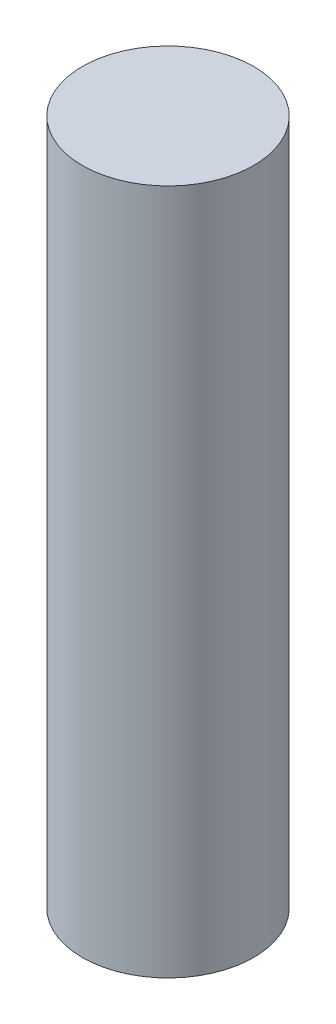
ISO-10303-21;
HEADER;
FILE_DESCRIPTION(('STEP AP214'),'2;1');
FILE_NAME('part.step','',(''),(''),'','','');
FILE_SCHEMA(('AUTOMOTIVE_DESIGN { 1 0 10303 214 1 1 1 1 }'));
ENDSEC;
DATA;
#1=APPLICATION_CONTEXT('core data for automotive mechanical design processes');
#2=APPLICATION_PROTOCOL_DEFINITION('international standard','automotive_design',2000,#1);
#3=PRODUCT_CONTEXT('',#1,'mechanical');
#4=PRODUCT('Part','Part','',(#3));
#5=PRODUCT_RELATED_PRODUCT_CATEGORY('part','',(#4));
#6=PRODUCT_DEFINITION_FORMATION('','',#4);
#7=PRODUCT_DEFINITION_CONTEXT('part definition',#1,'design');
#8=PRODUCT_DEFINITION('design','',#6,#7);
#9=PRODUCT_DEFINITION_SHAPE('','',#8);
#10=(LENGTH_UNIT() NAMED_UNIT(*) SI_UNIT(.MILLI.,.METRE.));
#11=(NAMED_UNIT(*) PLANE_ANGLE_UNIT() SI_UNIT($,.RADIAN.));
#12=(NAMED_UNIT(*) SI_UNIT($,.STERADIAN.) SOLID_ANGLE_UNIT());
#13=UNCERTAINTY_MEASURE_WITH_UNIT(LENGTH_MEASURE(1.E-05),#10,'distance_accuracy_value','');
#14=(GEOMETRIC_REPRESENTATION_CONTEXT(3) GLOBAL_UNCERTAINTY_ASSIGNED_CONTEXT((#13)) GLOBAL_UNIT_ASSIGNED_CONTEXT((#10,
#11,#12)) REPRESENTATION_CONTEXT('',''));
#15=CARTESIAN_POINT('',(0.,0.,0.));
#16=DIRECTION('',(0.,0.,1.));
#17=DIRECTION('',(1.,0.,0.));
#18=AXIS2_PLACEMENT_3D('',#15,#16,#17);
#19=CARTESIAN_POINT('',(-0.389434893795866,-5.34244167768412,-13.4799818499073));
#20=DIRECTION('',(0.,1.,0.));
#21=DIRECTION('',(0.,0.,1.));
#22=AXIS2_PLACEMENT_3D('',#19,#20,#21);
#23=CYLINDRICAL_SURFACE('',#22,1.25);
#24=CARTESIAN_POINT('',(-0.389434893795866,-5.34244167768412,-13.4799818499073));
#25=DIRECTION('',(0.,-1.,0.));
#26=DIRECTION('',(0.,0.,-1.));
#27=AXIS2_PLACEMENT_3D('',#24,#25,#26);
#28=CIRCLE('',#27,1.25);
#29=CARTESIAN_POINT('',(-0.389434893795866,-5.34244167768412,-14.7299818499073));
#30=VERTEX_POINT('',#29);
#31=EDGE_CURVE('E10',#30,#30,#28,.T.);
#32=ORIENTED_EDGE('',*,*,#31,.F.);
#33=EDGE_LOOP('',(#32));
#34=FACE_BOUND('',#33,.T.);
#35=CARTESIAN_POINT('',(-0.389434893795866,4.65755832231588,-13.4799818499073));
#36=DIRECTION('',(0.,-1.,0.));
#37=DIRECTION('',(0.,0.,-1.));
#38=AXIS2_PLACEMENT_3D('',#35,#36,#37);
#39=CIRCLE('',#38,1.25);
#40=CARTESIAN_POINT('',(-0.389434893795866,4.65755832231588,-14.7299818499073));
#41=VERTEX_POINT('',#40);
#42=EDGE_CURVE('E31',#41,#41,#39,.T.);
#43=ORIENTED_EDGE('',*,*,#42,.T.);
#44=EDGE_LOOP('',(#43));
#45=FACE_BOUND('',#44,.T.);
#46=ADVANCED_FACE('F28',(#34,#45),#23,.T.);
#47=CARTESIAN_POINT('',(-0.389434893795866,-5.34244167768412,-13.4799818499073));
#48=DIRECTION('',(0.,-1.,0.));
#49=DIRECTION('',(0.,0.,-1.));
#50=AXIS2_PLACEMENT_3D('',#47,#48,#49);
#51=PLANE('',#50);
#52=ORIENTED_EDGE('',*,*,#31,.T.);
#53=EDGE_LOOP('',(#52));
#54=FACE_BOUND('',#53,.T.);
#55=ADVANCED_FACE('F43',(#54),#51,.T.);
#56=CARTESIAN_POINT('',(-0.389434893795866,4.65755832231588,-13.4799818499073));
#57=DIRECTION('',(0.,-1.,0.));
#58=DIRECTION('',(0.,0.,-1.));
#59=AXIS2_PLACEMENT_3D('',#56,#57,#58);
#60=PLANE('',#59);
#61=ORIENTED_EDGE('',*,*,#42,.F.);
#62=EDGE_LOOP('',(#61));
#63=FACE_BOUND('',#62,.T.);
#64=ADVANCED_FACE('F41',(#63),#60,.F.);
#65=CLOSED_SHELL('',(#46,#55,#64));
#66=MANIFOLD_SOLID_BREP('B2',#65);
#67=ADVANCED_BREP_SHAPE_REPRESENTATION('',(#18,#66),#14);
#68=SHAPE_DEFINITION_REPRESENTATION(#9,#67);
ENDSEC;
END-ISO-10303-21;
